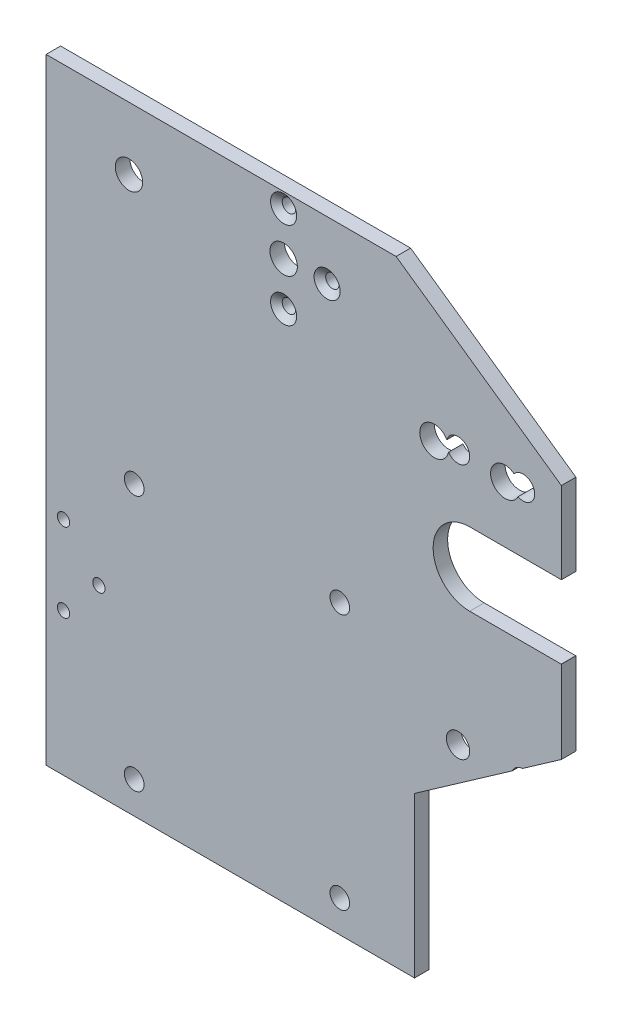
ISO-10303-21;
HEADER;
FILE_DESCRIPTION(('STEP AP214'),'2;1');
FILE_NAME('part.step','',(''),(''),'','','');
FILE_SCHEMA(('AUTOMOTIVE_DESIGN { 1 0 10303 214 1 1 1 1 }'));
ENDSEC;
DATA;
#1=APPLICATION_CONTEXT('core data for automotive mechanical design processes');
#2=APPLICATION_PROTOCOL_DEFINITION('international standard','automotive_design',2000,#1);
#3=PRODUCT_CONTEXT('',#1,'mechanical');
#4=PRODUCT('Part','Part','',(#3));
#5=PRODUCT_RELATED_PRODUCT_CATEGORY('part','',(#4));
#6=PRODUCT_DEFINITION_FORMATION('','',#4);
#7=PRODUCT_DEFINITION_CONTEXT('part definition',#1,'design');
#8=PRODUCT_DEFINITION('design','',#6,#7);
#9=PRODUCT_DEFINITION_SHAPE('','',#8);
#10=(LENGTH_UNIT() NAMED_UNIT(*) SI_UNIT(.MILLI.,.METRE.));
#11=(NAMED_UNIT(*) PLANE_ANGLE_UNIT() SI_UNIT($,.RADIAN.));
#12=(NAMED_UNIT(*) SI_UNIT($,.STERADIAN.) SOLID_ANGLE_UNIT());
#13=UNCERTAINTY_MEASURE_WITH_UNIT(LENGTH_MEASURE(1.E-05),#10,'distance_accuracy_value','');
#14=(GEOMETRIC_REPRESENTATION_CONTEXT(3) GLOBAL_UNCERTAINTY_ASSIGNED_CONTEXT((#13)) GLOBAL_UNIT_ASSIGNED_CONTEXT((#10,
#11,#12)) REPRESENTATION_CONTEXT('',''));
#15=CARTESIAN_POINT('',(0.,0.,0.));
#16=DIRECTION('',(0.,0.,1.));
#17=DIRECTION('',(1.,0.,0.));
#18=AXIS2_PLACEMENT_3D('',#15,#16,#17);
#19=CARTESIAN_POINT('',(80.144,22.4872878022684,11.8));
#20=DIRECTION('',(0.57357643635105,-0.819152044288989,0.));
#21=DIRECTION('',(0.819152044288989,0.57357643635105,0.));
#22=AXIS2_PLACEMENT_3D('',#19,#20,#21);
#23=PLANE('',#22);
#24=DIRECTION('',(0.,0.,1.));
#25=VECTOR('',#24,1.);
#26=CARTESIAN_POINT('',(71.6210299751706,16.5194399429474,14.975));
#27=LINE('',#26,#25);
#28=CARTESIAN_POINT('',(71.6210299751706,16.5194399429473,11.8));
#29=VERTEX_POINT('',#28);
#30=CARTESIAN_POINT('',(71.6210299751706,16.5194399429474,14.975));
#31=VERTEX_POINT('',#30);
#32=EDGE_CURVE('E11',#29,#31,#27,.T.);
#33=ORIENTED_EDGE('',*,*,#32,.F.);
#34=DIRECTION('',(-0.819152044288989,-0.57357643635105,0.));
#35=VECTOR('',#34,1.);
#36=CARTESIAN_POINT('',(53.1338099316063,3.57454910790182,11.8));
#37=LINE('',#36,#35);
#38=CARTESIAN_POINT('',(80.144,22.4872878022684,11.8));
#39=VERTEX_POINT('',#38);
#40=EDGE_CURVE('E170',#39,#29,#37,.T.);
#41=ORIENTED_EDGE('',*,*,#40,.F.);
#42=DIRECTION('',(0.,0.,-1.));
#43=VECTOR('',#42,1.);
#44=CARTESIAN_POINT('',(80.144,22.4872878022684,11.8));
#45=LINE('',#44,#43);
#46=CARTESIAN_POINT('',(80.144,22.4872878022684,14.975));
#47=VERTEX_POINT('',#46);
#48=EDGE_CURVE('E310',#47,#39,#45,.T.);
#49=ORIENTED_EDGE('',*,*,#48,.F.);
#50=DIRECTION('',(-0.819152044288989,-0.57357643635105,0.));
#51=VECTOR('',#50,1.);
#52=CARTESIAN_POINT('',(80.144,22.4872878022684,14.975));
#53=LINE('',#52,#51);
#54=EDGE_CURVE('E173',#47,#31,#53,.T.);
#55=ORIENTED_EDGE('',*,*,#54,.T.);
#56=EDGE_LOOP('',(#33,#41,#49,#55));
#57=FACE_BOUND('',#56,.T.);
#58=ADVANCED_FACE('F33',(#57),#23,.T.);
#59=CARTESIAN_POINT('',(80.144,-35.,11.8));
#60=DIRECTION('',(0.,0.,-1.));
#61=DIRECTION('',(-1.,0.,0.));
#62=AXIS2_PLACEMENT_3D('',#59,#60,#61);
#63=PLANE('',#62);
#64=CARTESIAN_POINT('',(-14.5061,86.034,11.8));
#65=DIRECTION('',(0.,0.,1.));
#66=DIRECTION('',(1.,0.,0.));
#67=AXIS2_PLACEMENT_3D('',#64,#65,#66);
#68=CIRCLE('',#67,2.9972);
#69=CARTESIAN_POINT('',(-11.5089,86.034,11.8));
#70=VERTEX_POINT('',#69);
#71=EDGE_CURVE('E503',#70,#70,#68,.T.);
#72=ORIENTED_EDGE('',*,*,#71,.T.);
#73=EDGE_LOOP('',(#72));
#74=FACE_BOUND('',#73,.T.);
#75=CARTESIAN_POINT('',(57.526,13.97,11.8));
#76=DIRECTION('',(0.,0.,1.));
#77=DIRECTION('',(1.,0.,0.));
#78=AXIS2_PLACEMENT_3D('',#75,#76,#77);
#79=CIRCLE('',#78,2.5527);
#80=CARTESIAN_POINT('',(60.0787,13.97,11.8));
#81=VERTEX_POINT('',#80);
#82=EDGE_CURVE('E360',#81,#81,#79,.T.);
#83=ORIENTED_EDGE('',*,*,#82,.T.);
#84=EDGE_LOOP('',(#83));
#85=FACE_BOUND('',#84,.T.);
#86=CARTESIAN_POINT('',(71.75,13.97,11.8));
#87=DIRECTION('',(0.,0.,1.));
#88=DIRECTION('',(1.,0.,0.));
#89=AXIS2_PLACEMENT_3D('',#86,#87,#88);
#90=CIRCLE('',#89,2.55269999999999);
#91=CARTESIAN_POINT('',(69.3984204448524,14.9631519953218,11.8));
#92=VERTEX_POINT('',#91);
#93=EDGE_CURVE('E161',#29,#92,#90,.T.);
#94=ORIENTED_EDGE('',*,*,#93,.T.);
#95=CARTESIAN_POINT('',(48.,-0.0201833059448077,11.8));
#96=VERTEX_POINT('',#95);
#97=EDGE_CURVE('E181',#92,#96,#37,.T.);
#98=ORIENTED_EDGE('',*,*,#97,.T.);
#99=DIRECTION('',(0.,-1.,0.));
#100=VECTOR('',#99,1.);
#101=CARTESIAN_POINT('',(48.,-35.,11.8));
#102=LINE('',#101,#100);
#103=CARTESIAN_POINT('',(48.,-35.,11.8));
#104=VERTEX_POINT('',#103);
#105=EDGE_CURVE('E186',#96,#104,#102,.T.);
#106=ORIENTED_EDGE('',*,*,#105,.T.);
#107=DIRECTION('',(-1.,0.,0.));
#108=VECTOR('',#107,1.);
#109=CARTESIAN_POINT('',(80.144,-35.,11.8));
#110=LINE('',#109,#108);
#111=CARTESIAN_POINT('',(-32.638,-35.,11.8));
#112=VERTEX_POINT('',#111);
#113=EDGE_CURVE('E200',#104,#112,#110,.T.);
#114=ORIENTED_EDGE('',*,*,#113,.T.);
#115=DIRECTION('',(0.,1.,0.));
#116=VECTOR('',#115,1.);
#117=CARTESIAN_POINT('',(-32.638,-35.,11.8));
#118=LINE('',#117,#116);
#119=CARTESIAN_POINT('',(-32.638,99.75,11.8));
#120=VERTEX_POINT('',#119);
#121=EDGE_CURVE('E203',#112,#120,#118,.T.);
#122=ORIENTED_EDGE('',*,*,#121,.T.);
#123=DIRECTION('',(-1.,0.,0.));
#124=VECTOR('',#123,1.);
#125=CARTESIAN_POINT('',(80.144,99.75,11.8));
#126=LINE('',#125,#124);
#127=CARTESIAN_POINT('',(43.9646872762982,99.75,11.8));
#128=VERTEX_POINT('',#127);
#129=EDGE_CURVE('E192',#128,#120,#126,.T.);
#130=ORIENTED_EDGE('',*,*,#129,.F.);
#131=DIRECTION('',(0.819152044288993,-0.573576436351044,0.));
#132=VECTOR('',#131,1.);
#133=CARTESIAN_POINT('',(131.553160825192,38.4198905607832,11.8));
#134=LINE('',#133,#132);
#135=CARTESIAN_POINT('',(80.144,74.4169725036177,11.8));
#136=VERTEX_POINT('',#135);
#137=EDGE_CURVE('E272',#128,#136,#134,.T.);
#138=ORIENTED_EDGE('',*,*,#137,.T.);
#139=DIRECTION('',(0.,1.,0.));
#140=VECTOR('',#139,1.);
#141=CARTESIAN_POINT('',(80.144,-35.,11.8));
#142=LINE('',#141,#140);
#143=CARTESIAN_POINT('',(80.144,56.5500397172487,11.8));
#144=VERTEX_POINT('',#143);
#145=EDGE_CURVE('E208',#144,#136,#142,.T.);
#146=ORIENTED_EDGE('',*,*,#145,.F.);
#147=CARTESIAN_POINT('',(80.066,48.550419976286,11.8));
#148=DIRECTION('',(0.,0.,-1.));
#149=DIRECTION('',(-1.,0.,0.));
#150=AXIS2_PLACEMENT_3D('',#147,#148,#149);
#151=CIRCLE('',#150,8.00000000000001);
#152=CARTESIAN_POINT('',(80.066,56.550419976286,11.8));
#153=VERTEX_POINT('',#152);
#154=EDGE_CURVE('E285',#144,#153,#151,.F.);
#155=ORIENTED_EDGE('',*,*,#154,.T.);
#156=DIRECTION('',(-1.,0.,0.));
#157=VECTOR('',#156,1.);
#158=CARTESIAN_POINT('',(80.144,56.550419976286,11.8));
#159=LINE('',#158,#157);
#160=CARTESIAN_POINT('',(60.066,56.550419976286,11.8));
#161=VERTEX_POINT('',#160);
#162=EDGE_CURVE('E279',#153,#161,#159,.T.);
#163=ORIENTED_EDGE('',*,*,#162,.T.);
#164=CARTESIAN_POINT('',(60.066,48.550419976286,11.8));
#165=DIRECTION('',(0.,0.,-1.));
#166=DIRECTION('',(-1.,0.,0.));
#167=AXIS2_PLACEMENT_3D('',#164,#165,#166);
#168=CIRCLE('',#167,8.00000000000001);
#169=CARTESIAN_POINT('',(60.066,40.550419976286,11.8));
#170=VERTEX_POINT('',#169);
#171=EDGE_CURVE('E295',#161,#170,#168,.F.);
#172=ORIENTED_EDGE('',*,*,#171,.T.);
#173=DIRECTION('',(1.,0.,0.));
#174=VECTOR('',#173,1.);
#175=CARTESIAN_POINT('',(80.144,40.550419976286,11.8));
#176=LINE('',#175,#174);
#177=CARTESIAN_POINT('',(80.066,40.550419976286,11.8));
#178=VERTEX_POINT('',#177);
#179=EDGE_CURVE('E292',#170,#178,#176,.T.);
#180=ORIENTED_EDGE('',*,*,#179,.T.);
#181=CARTESIAN_POINT('',(80.144,40.5508002353233,11.8));
#182=VERTEX_POINT('',#181);
#183=EDGE_CURVE('E289',#178,#182,#151,.F.);
#184=ORIENTED_EDGE('',*,*,#183,.T.);
#185=EDGE_CURVE('E179',#39,#182,#142,.T.);
#186=ORIENTED_EDGE('',*,*,#185,.F.);
#187=ORIENTED_EDGE('',*,*,#40,.T.);
#188=EDGE_LOOP('',(#94,#98,#106,#114,#122,#130,#138,#146,#155,#163,#172,#180,#184,#186,#187));
#189=FACE_BOUND('',#188,.T.);
#190=CARTESIAN_POINT('',(71.75,69.85,11.8));
#191=DIRECTION('',(0.,0.,1.));
#192=DIRECTION('',(1.,0.,0.));
#193=AXIS2_PLACEMENT_3D('',#190,#191,#192);
#194=CIRCLE('',#193,2.55269999999999);
#195=CARTESIAN_POINT('',(70.6516698350332,67.5456675286053,11.8));
#196=VERTEX_POINT('',#195);
#197=CARTESIAN_POINT('',(69.7775469529654,71.4704031187466,11.8));
#198=VERTEX_POINT('',#197);
#199=EDGE_CURVE('E226',#196,#198,#194,.T.);
#200=ORIENTED_EDGE('',*,*,#199,.T.);
#201=CARTESIAN_POINT('',(67.8159999999999,68.9738137349449,11.8));
#202=DIRECTION('',(0.,0.,-1.));
#203=DIRECTION('',(-1.,0.,0.));
#204=AXIS2_PLACEMENT_3D('',#201,#202,#203);
#205=CIRCLE('',#204,3.175);
#206=EDGE_CURVE('E298',#198,#196,#205,.F.);
#207=ORIENTED_EDGE('',*,*,#206,.T.);
#208=EDGE_LOOP('',(#200,#207));
#209=FACE_BOUND('',#208,.T.);
#210=CARTESIAN_POINT('',(-28.824,-3.75800000000003,11.8));
#211=DIRECTION('',(0.,0.,1.));
#212=DIRECTION('',(1.,0.,0.));
#213=AXIS2_PLACEMENT_3D('',#210,#211,#212);
#214=CIRCLE('',#213,1.35255);
#215=CARTESIAN_POINT('',(-27.47145,-3.75800000000003,11.8));
#216=VERTEX_POINT('',#215);
#217=EDGE_CURVE('E376',#216,#216,#214,.T.);
#218=ORIENTED_EDGE('',*,*,#217,.T.);
#219=EDGE_LOOP('',(#218));
#220=FACE_BOUND('',#219,.T.);
#221=CARTESIAN_POINT('',(-21.077,4.87799999999997,11.8));
#222=DIRECTION('',(0.,0.,1.));
#223=DIRECTION('',(1.,0.,0.));
#224=AXIS2_PLACEMENT_3D('',#221,#222,#223);
#225=CIRCLE('',#224,1.35255);
#226=CARTESIAN_POINT('',(-19.72445,4.87799999999997,11.8));
#227=VERTEX_POINT('',#226);
#228=EDGE_CURVE('E382',#227,#227,#225,.T.);
#229=ORIENTED_EDGE('',*,*,#228,.T.);
#230=EDGE_LOOP('',(#229));
#231=FACE_BOUND('',#230,.T.);
#232=CARTESIAN_POINT('',(-28.824,13.514,11.8));
#233=DIRECTION('',(0.,0.,1.));
#234=DIRECTION('',(1.,0.,0.));
#235=AXIS2_PLACEMENT_3D('',#232,#233,#234);
#236=CIRCLE('',#235,1.35255);
#237=CARTESIAN_POINT('',(-27.47145,13.514,11.8));
#238=VERTEX_POINT('',#237);
#239=EDGE_CURVE('E388',#238,#238,#236,.T.);
#240=ORIENTED_EDGE('',*,*,#239,.T.);
#241=EDGE_LOOP('',(#240));
#242=FACE_BOUND('',#241,.T.);
#243=CARTESIAN_POINT('',(19.352,87.0000000000002,11.8));
#244=DIRECTION('',(0.,0.,-1.));
#245=DIRECTION('',(-1.,0.,0.));
#246=AXIS2_PLACEMENT_3D('',#243,#244,#245);
#247=CIRCLE('',#246,3.);
#248=CARTESIAN_POINT('',(16.352,87.0000000000002,11.8));
#249=VERTEX_POINT('',#248);
#250=EDGE_CURVE('E394',#249,#249,#247,.T.);
#251=ORIENTED_EDGE('',*,*,#250,.F.);
#252=EDGE_LOOP('',(#251));
#253=FACE_BOUND('',#252,.T.);
#254=CARTESIAN_POINT('',(19.352,96.5190714883335,11.8));
#255=DIRECTION('',(0.,0.,1.));
#256=DIRECTION('',(1.,0.,0.));
#257=AXIS2_PLACEMENT_3D('',#254,#255,#256);
#258=CIRCLE('',#257,1.4732);
#259=CARTESIAN_POINT('',(20.8252,96.5190714883335,11.8));
#260=VERTEX_POINT('',#259);
#261=EDGE_CURVE('E403',#260,#260,#258,.T.);
#262=ORIENTED_EDGE('',*,*,#261,.T.);
#263=EDGE_LOOP('',(#262));
#264=FACE_BOUND('',#263,.T.);
#265=CARTESIAN_POINT('',(28.8710714883333,87.0000000000002,11.8));
#266=DIRECTION('',(0.,0.,1.));
#267=DIRECTION('',(1.,0.,0.));
#268=AXIS2_PLACEMENT_3D('',#265,#266,#267);
#269=CIRCLE('',#268,1.4732);
#270=CARTESIAN_POINT('',(30.3442714883333,87.0000000000002,11.8));
#271=VERTEX_POINT('',#270);
#272=EDGE_CURVE('E412',#271,#271,#269,.T.);
#273=ORIENTED_EDGE('',*,*,#272,.T.);
#274=EDGE_LOOP('',(#273));
#275=FACE_BOUND('',#274,.T.);
#276=CARTESIAN_POINT('',(19.352,77.4809285116669,11.8));
#277=DIRECTION('',(0.,0.,1.));
#278=DIRECTION('',(1.,0.,0.));
#279=AXIS2_PLACEMENT_3D('',#276,#277,#278);
#280=CIRCLE('',#279,1.4732);
#281=CARTESIAN_POINT('',(20.8252,77.4809285116669,11.8));
#282=VERTEX_POINT('',#281);
#283=EDGE_CURVE('E421',#282,#282,#280,.T.);
#284=ORIENTED_EDGE('',*,*,#283,.T.);
#285=EDGE_LOOP('',(#284));
#286=FACE_BOUND('',#285,.T.);
#287=CARTESIAN_POINT('',(-13.356,28.,11.8));
#288=DIRECTION('',(0.,0.,1.));
#289=DIRECTION('',(1.,0.,0.));
#290=AXIS2_PLACEMENT_3D('',#287,#288,#289);
#291=CIRCLE('',#290,2.15);
#292=CARTESIAN_POINT('',(-11.206,28.,11.8));
#293=VERTEX_POINT('',#292);
#294=EDGE_CURVE('E427',#293,#293,#291,.T.);
#295=ORIENTED_EDGE('',*,*,#294,.T.);
#296=EDGE_LOOP('',(#295));
#297=FACE_BOUND('',#296,.T.);
#298=CARTESIAN_POINT('',(31.644,28.,11.8));
#299=DIRECTION('',(0.,0.,1.));
#300=DIRECTION('',(1.,0.,0.));
#301=AXIS2_PLACEMENT_3D('',#298,#299,#300);
#302=CIRCLE('',#301,2.15);
#303=CARTESIAN_POINT('',(33.794,28.,11.8));
#304=VERTEX_POINT('',#303);
#305=EDGE_CURVE('E433',#304,#304,#302,.T.);
#306=ORIENTED_EDGE('',*,*,#305,.T.);
#307=EDGE_LOOP('',(#306));
#308=FACE_BOUND('',#307,.T.);
#309=CARTESIAN_POINT('',(31.644,-28.,11.8));
#310=DIRECTION('',(0.,0.,1.));
#311=DIRECTION('',(1.,0.,0.));
#312=AXIS2_PLACEMENT_3D('',#309,#310,#311);
#313=CIRCLE('',#312,2.15);
#314=CARTESIAN_POINT('',(33.794,-28.,11.8));
#315=VERTEX_POINT('',#314);
#316=EDGE_CURVE('E439',#315,#315,#313,.T.);
#317=ORIENTED_EDGE('',*,*,#316,.T.);
#318=EDGE_LOOP('',(#317));
#319=FACE_BOUND('',#318,.T.);
#320=CARTESIAN_POINT('',(-13.356,-28.,11.8));
#321=DIRECTION('',(0.,0.,1.));
#322=DIRECTION('',(1.,0.,0.));
#323=AXIS2_PLACEMENT_3D('',#320,#321,#322);
#324=CIRCLE('',#323,2.15);
#325=CARTESIAN_POINT('',(-11.206,-28.,11.8));
#326=VERTEX_POINT('',#325);
#327=EDGE_CURVE('E244',#326,#326,#324,.T.);
#328=ORIENTED_EDGE('',*,*,#327,.T.);
#329=EDGE_LOOP('',(#328));
#330=FACE_BOUND('',#329,.T.);
#331=CARTESIAN_POINT('',(52.3159999999998,68.9738137349447,11.8));
#332=DIRECTION('',(0.,0.,-1.));
#333=DIRECTION('',(-1.,0.,0.));
#334=AXIS2_PLACEMENT_3D('',#331,#332,#333);
#335=CIRCLE('',#334,3.175);
#336=CARTESIAN_POINT('',(55.0714782371765,70.5511420724971,11.8));
#337=VERTEX_POINT('',#336);
#338=CARTESIAN_POINT('',(55.4358407315599,68.3845609795853,11.8));
#339=VERTEX_POINT('',#338);
#340=EDGE_CURVE('E300',#337,#339,#335,.F.);
#341=ORIENTED_EDGE('',*,*,#340,.T.);
#342=CARTESIAN_POINT('',(57.526,69.85,11.8));
#343=DIRECTION('',(0.,0.,1.));
#344=DIRECTION('',(1.,0.,0.));
#345=AXIS2_PLACEMENT_3D('',#342,#343,#344);
#346=CIRCLE('',#345,2.5527);
#347=EDGE_CURVE('E370',#339,#337,#346,.T.);
#348=ORIENTED_EDGE('',*,*,#347,.T.);
#349=EDGE_LOOP('',(#341,#348));
#350=FACE_BOUND('',#349,.T.);
#351=ADVANCED_FACE('F175',(#74,#85,#189,#209,#220,#231,#242,#253,#264,#275,#286,#297,#308,#319,
#330,#350),#63,.T.);
#352=CARTESIAN_POINT('',(80.144,-35.,14.975));
#353=DIRECTION('',(1.,0.,0.));
#354=DIRECTION('',(0.,0.,-1.));
#355=AXIS2_PLACEMENT_3D('',#352,#353,#354);
#356=PLANE('',#355);
#357=ORIENTED_EDGE('',*,*,#145,.T.);
#358=DIRECTION('',(0.,0.,-1.));
#359=VECTOR('',#358,1.);
#360=CARTESIAN_POINT('',(80.144,74.4169725036177,11.8));
#361=LINE('',#360,#359);
#362=CARTESIAN_POINT('',(80.144,74.4169725036177,14.975));
#363=VERTEX_POINT('',#362);
#364=EDGE_CURVE('E241',#363,#136,#361,.T.);
#365=ORIENTED_EDGE('',*,*,#364,.F.);
#366=DIRECTION('',(0.,1.,0.));
#367=VECTOR('',#366,1.);
#368=CARTESIAN_POINT('',(80.144,-35.,14.975));
#369=LINE('',#368,#367);
#370=CARTESIAN_POINT('',(80.144,56.5500397172487,14.975));
#371=VERTEX_POINT('',#370);
#372=EDGE_CURVE('E212',#371,#363,#369,.T.);
#373=ORIENTED_EDGE('',*,*,#372,.F.);
#374=DIRECTION('',(0.,0.,-1.));
#375=VECTOR('',#374,1.);
#376=CARTESIAN_POINT('',(80.144,56.5500397172487,11.8));
#377=LINE('',#376,#375);
#378=EDGE_CURVE('E282',#371,#144,#377,.T.);
#379=ORIENTED_EDGE('',*,*,#378,.T.);
#380=EDGE_LOOP('',(#357,#365,#373,#379));
#381=FACE_BOUND('',#380,.T.);
#382=ADVANCED_FACE('F341',(#381),#356,.T.);
#383=ORIENTED_EDGE('',*,*,#185,.T.);
#384=DIRECTION('',(0.,0.,-1.));
#385=VECTOR('',#384,1.);
#386=CARTESIAN_POINT('',(80.144,40.5508002353233,11.8));
#387=LINE('',#386,#385);
#388=CARTESIAN_POINT('',(80.144,40.5508002353233,14.975));
#389=VERTEX_POINT('',#388);
#390=EDGE_CURVE('E288',#182,#389,#387,.F.);
#391=ORIENTED_EDGE('',*,*,#390,.T.);
#392=EDGE_CURVE('E209',#47,#389,#369,.T.);
#393=ORIENTED_EDGE('',*,*,#392,.F.);
#394=ORIENTED_EDGE('',*,*,#48,.T.);
#395=EDGE_LOOP('',(#383,#391,#393,#394));
#396=FACE_BOUND('',#395,.T.);
#397=ADVANCED_FACE('F357',(#396),#356,.T.);
#398=CARTESIAN_POINT('',(-32.638,-35.,14.975));
#399=DIRECTION('',(0.,0.,1.));
#400=DIRECTION('',(1.,0.,0.));
#401=AXIS2_PLACEMENT_3D('',#398,#399,#400);
#402=PLANE('',#401);
#403=CARTESIAN_POINT('',(-14.5061,86.034,14.975));
#404=DIRECTION('',(0.,0.,1.));
#405=DIRECTION('',(1.,0.,0.));
#406=AXIS2_PLACEMENT_3D('',#403,#404,#405);
#407=CIRCLE('',#406,2.9972);
#408=CARTESIAN_POINT('',(-11.5089,86.034,14.975));
#409=VERTEX_POINT('',#408);
#410=EDGE_CURVE('E499',#409,#409,#407,.T.);
#411=ORIENTED_EDGE('',*,*,#410,.F.);
#412=EDGE_LOOP('',(#411));
#413=FACE_BOUND('',#412,.T.);
#414=CARTESIAN_POINT('',(57.526,13.97,14.975));
#415=DIRECTION('',(0.,0.,1.));
#416=DIRECTION('',(1.,0.,0.));
#417=AXIS2_PLACEMENT_3D('',#414,#415,#416);
#418=CIRCLE('',#417,2.5527);
#419=CARTESIAN_POINT('',(60.0787,13.97,14.975));
#420=VERTEX_POINT('',#419);
#421=EDGE_CURVE('E363',#420,#420,#418,.T.);
#422=ORIENTED_EDGE('',*,*,#421,.F.);
#423=EDGE_LOOP('',(#422));
#424=FACE_BOUND('',#423,.T.);
#425=CARTESIAN_POINT('',(71.75,13.97,14.975));
#426=DIRECTION('',(0.,0.,1.));
#427=DIRECTION('',(1.,0.,0.));
#428=AXIS2_PLACEMENT_3D('',#425,#426,#427);
#429=CIRCLE('',#428,2.55270000000001);
#430=CARTESIAN_POINT('',(69.3984204448524,14.9631519953218,14.975));
#431=VERTEX_POINT('',#430);
#432=EDGE_CURVE('E47',#31,#431,#429,.T.);
#433=ORIENTED_EDGE('',*,*,#432,.F.);
#434=ORIENTED_EDGE('',*,*,#54,.F.);
#435=ORIENTED_EDGE('',*,*,#392,.T.);
#436=CARTESIAN_POINT('',(80.066,48.550419976286,14.975));
#437=DIRECTION('',(0.,0.,1.));
#438=DIRECTION('',(1.,0.,0.));
#439=AXIS2_PLACEMENT_3D('',#436,#437,#438);
#440=CIRCLE('',#439,8.00000000000001);
#441=CARTESIAN_POINT('',(80.066,40.550419976286,14.975));
#442=VERTEX_POINT('',#441);
#443=EDGE_CURVE('E256',#442,#389,#440,.T.);
#444=ORIENTED_EDGE('',*,*,#443,.F.);
#445=DIRECTION('',(1.,0.,0.));
#446=VECTOR('',#445,1.);
#447=CARTESIAN_POINT('',(60.066,40.550419976286,14.975));
#448=LINE('',#447,#446);
#449=CARTESIAN_POINT('',(60.066,40.550419976286,14.975));
#450=VERTEX_POINT('',#449);
#451=EDGE_CURVE('E252',#450,#442,#448,.T.);
#452=ORIENTED_EDGE('',*,*,#451,.F.);
#453=CARTESIAN_POINT('',(60.066,48.550419976286,14.975));
#454=DIRECTION('',(0.,0.,1.));
#455=DIRECTION('',(1.,0.,0.));
#456=AXIS2_PLACEMENT_3D('',#453,#454,#455);
#457=CIRCLE('',#456,8.00000000000001);
#458=CARTESIAN_POINT('',(60.066,56.550419976286,14.975));
#459=VERTEX_POINT('',#458);
#460=EDGE_CURVE('E249',#459,#450,#457,.T.);
#461=ORIENTED_EDGE('',*,*,#460,.F.);
#462=DIRECTION('',(-1.,0.,0.));
#463=VECTOR('',#462,1.);
#464=CARTESIAN_POINT('',(60.066,56.550419976286,14.975));
#465=LINE('',#464,#463);
#466=CARTESIAN_POINT('',(80.066,56.550419976286,14.975));
#467=VERTEX_POINT('',#466);
#468=EDGE_CURVE('E258',#467,#459,#465,.T.);
#469=ORIENTED_EDGE('',*,*,#468,.F.);
#470=CARTESIAN_POINT('',(80.066,48.550419976286,14.975));
#471=DIRECTION('',(0.,0.,1.));
#472=DIRECTION('',(1.,0.,0.));
#473=AXIS2_PLACEMENT_3D('',#470,#471,#472);
#474=CIRCLE('',#473,8.00000000000001);
#475=EDGE_CURVE('E206',#467,#371,#474,.F.);
#476=ORIENTED_EDGE('',*,*,#475,.T.);
#477=ORIENTED_EDGE('',*,*,#372,.T.);
#478=DIRECTION('',(0.819152044288993,-0.573576436351044,0.));
#479=VECTOR('',#478,1.);
#480=CARTESIAN_POINT('',(43.9646872762982,99.75,14.975));
#481=LINE('',#480,#479);
#482=CARTESIAN_POINT('',(43.9646872762982,99.75,14.975));
#483=VERTEX_POINT('',#482);
#484=EDGE_CURVE('E238',#483,#363,#481,.T.);
#485=ORIENTED_EDGE('',*,*,#484,.F.);
#486=DIRECTION('',(1.,0.,0.));
#487=VECTOR('',#486,1.);
#488=CARTESIAN_POINT('',(-32.638,99.75,14.975));
#489=LINE('',#488,#487);
#490=CARTESIAN_POINT('',(-32.638,99.75,14.975));
#491=VERTEX_POINT('',#490);
#492=EDGE_CURVE('E184',#491,#483,#489,.T.);
#493=ORIENTED_EDGE('',*,*,#492,.F.);
#494=DIRECTION('',(0.,1.,0.));
#495=VECTOR('',#494,1.);
#496=CARTESIAN_POINT('',(-32.638,-35.,14.975));
#497=LINE('',#496,#495);
#498=CARTESIAN_POINT('',(-32.638,-35.,14.975));
#499=VERTEX_POINT('',#498);
#500=EDGE_CURVE('E202',#499,#491,#497,.T.);
#501=ORIENTED_EDGE('',*,*,#500,.F.);
#502=DIRECTION('',(1.,0.,0.));
#503=VECTOR('',#502,1.);
#504=CARTESIAN_POINT('',(-32.638,-35.,14.975));
#505=LINE('',#504,#503);
#506=CARTESIAN_POINT('',(48.,-35.,14.975));
#507=VERTEX_POINT('',#506);
#508=EDGE_CURVE('E197',#499,#507,#505,.T.);
#509=ORIENTED_EDGE('',*,*,#508,.T.);
#510=DIRECTION('',(0.,-1.,0.));
#511=VECTOR('',#510,1.);
#512=CARTESIAN_POINT('',(48.,-35.,14.975));
#513=LINE('',#512,#511);
#514=CARTESIAN_POINT('',(48.,-0.0201833059448077,14.975));
#515=VERTEX_POINT('',#514);
#516=EDGE_CURVE('E303',#515,#507,#513,.T.);
#517=ORIENTED_EDGE('',*,*,#516,.F.);
#518=EDGE_CURVE('E305',#431,#515,#53,.T.);
#519=ORIENTED_EDGE('',*,*,#518,.F.);
#520=EDGE_LOOP('',(#433,#434,#435,#444,#452,#461,#469,#476,#477,#485,#493,#501,#509,#517,#519));
#521=FACE_BOUND('',#520,.T.);
#522=CARTESIAN_POINT('',(71.75,69.85,14.975));
#523=DIRECTION('',(0.,0.,1.));
#524=DIRECTION('',(1.,0.,0.));
#525=AXIS2_PLACEMENT_3D('',#522,#523,#524);
#526=CIRCLE('',#525,2.55270000000001);
#527=CARTESIAN_POINT('',(70.6516698350332,67.5456675286053,14.975));
#528=VERTEX_POINT('',#527);
#529=CARTESIAN_POINT('',(69.7775469529654,71.4704031187466,14.975));
#530=VERTEX_POINT('',#529);
#531=EDGE_CURVE('E55',#528,#530,#526,.T.);
#532=ORIENTED_EDGE('',*,*,#531,.F.);
#533=CARTESIAN_POINT('',(67.8159999999999,68.9738137349449,14.975));
#534=DIRECTION('',(0.,0.,1.));
#535=DIRECTION('',(1.,0.,0.));
#536=AXIS2_PLACEMENT_3D('',#533,#534,#535);
#537=CIRCLE('',#536,3.175);
#538=EDGE_CURVE('E235',#530,#528,#537,.T.);
#539=ORIENTED_EDGE('',*,*,#538,.F.);
#540=EDGE_LOOP('',(#532,#539));
#541=FACE_BOUND('',#540,.T.);
#542=CARTESIAN_POINT('',(57.526,69.85,14.975));
#543=DIRECTION('',(0.,0.,1.));
#544=DIRECTION('',(1.,0.,0.));
#545=AXIS2_PLACEMENT_3D('',#542,#543,#544);
#546=CIRCLE('',#545,2.5527);
#547=CARTESIAN_POINT('',(55.4358407315599,68.3845609795853,14.975));
#548=VERTEX_POINT('',#547);
#549=CARTESIAN_POINT('',(55.0714782371765,70.5511420724971,14.975));
#550=VERTEX_POINT('',#549);
#551=EDGE_CURVE('E368',#548,#550,#546,.T.);
#552=ORIENTED_EDGE('',*,*,#551,.F.);
#553=CARTESIAN_POINT('',(52.3159999999998,68.9738137349447,14.975));
#554=DIRECTION('',(0.,0.,1.));
#555=DIRECTION('',(1.,0.,0.));
#556=AXIS2_PLACEMENT_3D('',#553,#554,#555);
#557=CIRCLE('',#556,3.175);
#558=EDGE_CURVE('E239',#550,#548,#557,.T.);
#559=ORIENTED_EDGE('',*,*,#558,.F.);
#560=EDGE_LOOP('',(#552,#559));
#561=FACE_BOUND('',#560,.T.);
#562=CARTESIAN_POINT('',(-28.824,-3.75800000000003,14.975));
#563=DIRECTION('',(0.,0.,1.));
#564=DIRECTION('',(1.,0.,0.));
#565=AXIS2_PLACEMENT_3D('',#562,#563,#564);
#566=CIRCLE('',#565,1.35255);
#567=CARTESIAN_POINT('',(-27.47145,-3.75800000000003,14.975));
#568=VERTEX_POINT('',#567);
#569=EDGE_CURVE('E373',#568,#568,#566,.T.);
#570=ORIENTED_EDGE('',*,*,#569,.F.);
#571=EDGE_LOOP('',(#570));
#572=FACE_BOUND('',#571,.T.);
#573=CARTESIAN_POINT('',(-21.077,4.87799999999997,14.975));
#574=DIRECTION('',(0.,0.,1.));
#575=DIRECTION('',(1.,0.,0.));
#576=AXIS2_PLACEMENT_3D('',#573,#574,#575);
#577=CIRCLE('',#576,1.35255);
#578=CARTESIAN_POINT('',(-19.72445,4.87799999999997,14.975));
#579=VERTEX_POINT('',#578);
#580=EDGE_CURVE('E379',#579,#579,#577,.T.);
#581=ORIENTED_EDGE('',*,*,#580,.F.);
#582=EDGE_LOOP('',(#581));
#583=FACE_BOUND('',#582,.T.);
#584=CARTESIAN_POINT('',(-28.824,13.514,14.975));
#585=DIRECTION('',(0.,0.,1.));
#586=DIRECTION('',(1.,0.,0.));
#587=AXIS2_PLACEMENT_3D('',#584,#585,#586);
#588=CIRCLE('',#587,1.35255);
#589=CARTESIAN_POINT('',(-27.47145,13.514,14.975));
#590=VERTEX_POINT('',#589);
#591=EDGE_CURVE('E385',#590,#590,#588,.T.);
#592=ORIENTED_EDGE('',*,*,#591,.F.);
#593=EDGE_LOOP('',(#592));
#594=FACE_BOUND('',#593,.T.);
#595=CARTESIAN_POINT('',(19.352,87.0000000000002,14.975));
#596=DIRECTION('',(0.,0.,1.));
#597=DIRECTION('',(1.,0.,0.));
#598=AXIS2_PLACEMENT_3D('',#595,#596,#597);
#599=CIRCLE('',#598,3.);
#600=CARTESIAN_POINT('',(22.352,87.0000000000002,14.975));
#601=VERTEX_POINT('',#600);
#602=EDGE_CURVE('E391',#601,#601,#599,.T.);
#603=ORIENTED_EDGE('',*,*,#602,.F.);
#604=EDGE_LOOP('',(#603));
#605=FACE_BOUND('',#604,.T.);
#606=CARTESIAN_POINT('',(19.352,96.5190714883335,14.975));
#607=DIRECTION('',(0.,0.,1.));
#608=DIRECTION('',(1.,0.,0.));
#609=AXIS2_PLACEMENT_3D('',#606,#607,#608);
#610=CIRCLE('',#609,2.8575);
#611=CARTESIAN_POINT('',(22.2095,96.5190714883335,14.975));
#612=VERTEX_POINT('',#611);
#613=EDGE_CURVE('E397',#612,#612,#610,.T.);
#614=ORIENTED_EDGE('',*,*,#613,.F.);
#615=EDGE_LOOP('',(#614));
#616=FACE_BOUND('',#615,.T.);
#617=CARTESIAN_POINT('',(28.8710714883333,87.0000000000002,14.975));
#618=DIRECTION('',(0.,0.,1.));
#619=DIRECTION('',(1.,0.,0.));
#620=AXIS2_PLACEMENT_3D('',#617,#618,#619);
#621=CIRCLE('',#620,2.8575);
#622=CARTESIAN_POINT('',(31.7285714883333,87.0000000000002,14.975));
#623=VERTEX_POINT('',#622);
#624=EDGE_CURVE('E406',#623,#623,#621,.T.);
#625=ORIENTED_EDGE('',*,*,#624,.F.);
#626=EDGE_LOOP('',(#625));
#627=FACE_BOUND('',#626,.T.);
#628=CARTESIAN_POINT('',(19.352,77.4809285116669,14.975));
#629=DIRECTION('',(0.,0.,1.));
#630=DIRECTION('',(1.,0.,0.));
#631=AXIS2_PLACEMENT_3D('',#628,#629,#630);
#632=CIRCLE('',#631,2.8575);
#633=CARTESIAN_POINT('',(22.2095,77.4809285116669,14.975));
#634=VERTEX_POINT('',#633);
#635=EDGE_CURVE('E415',#634,#634,#632,.T.);
#636=ORIENTED_EDGE('',*,*,#635,.F.);
#637=EDGE_LOOP('',(#636));
#638=FACE_BOUND('',#637,.T.);
#639=CARTESIAN_POINT('',(-13.356,28.,14.975));
#640=DIRECTION('',(0.,0.,1.));
#641=DIRECTION('',(1.,0.,0.));
#642=AXIS2_PLACEMENT_3D('',#639,#640,#641);
#643=CIRCLE('',#642,2.15);
#644=CARTESIAN_POINT('',(-11.206,28.,14.975));
#645=VERTEX_POINT('',#644);
#646=EDGE_CURVE('E424',#645,#645,#643,.T.);
#647=ORIENTED_EDGE('',*,*,#646,.F.);
#648=EDGE_LOOP('',(#647));
#649=FACE_BOUND('',#648,.T.);
#650=CARTESIAN_POINT('',(31.644,28.,14.975));
#651=DIRECTION('',(0.,0.,1.));
#652=DIRECTION('',(1.,0.,0.));
#653=AXIS2_PLACEMENT_3D('',#650,#651,#652);
#654=CIRCLE('',#653,2.15);
#655=CARTESIAN_POINT('',(33.794,28.,14.975));
#656=VERTEX_POINT('',#655);
#657=EDGE_CURVE('E430',#656,#656,#654,.T.);
#658=ORIENTED_EDGE('',*,*,#657,.F.);
#659=EDGE_LOOP('',(#658));
#660=FACE_BOUND('',#659,.T.);
#661=CARTESIAN_POINT('',(31.644,-28.,14.975));
#662=DIRECTION('',(0.,0.,1.));
#663=DIRECTION('',(1.,0.,0.));
#664=AXIS2_PLACEMENT_3D('',#661,#662,#663);
#665=CIRCLE('',#664,2.15);
#666=CARTESIAN_POINT('',(33.794,-28.,14.975));
#667=VERTEX_POINT('',#666);
#668=EDGE_CURVE('E436',#667,#667,#665,.T.);
#669=ORIENTED_EDGE('',*,*,#668,.F.);
#670=EDGE_LOOP('',(#669));
#671=FACE_BOUND('',#670,.T.);
#672=CARTESIAN_POINT('',(-13.356,-28.,14.975));
#673=DIRECTION('',(0.,0.,1.));
#674=DIRECTION('',(1.,0.,0.));
#675=AXIS2_PLACEMENT_3D('',#672,#673,#674);
#676=CIRCLE('',#675,2.15);
#677=CARTESIAN_POINT('',(-11.206,-28.,14.975));
#678=VERTEX_POINT('',#677);
#679=EDGE_CURVE('E441',#678,#678,#676,.T.);
#680=ORIENTED_EDGE('',*,*,#679,.F.);
#681=EDGE_LOOP('',(#680));
#682=FACE_BOUND('',#681,.T.);
#683=ADVANCED_FACE('F233',(#413,#424,#521,#541,#561,#572,#583,#594,#605,#616,#627,#638,#649,
#660,#671,#682),#402,.T.);
#684=CARTESIAN_POINT('',(0.,99.75,0.));
#685=DIRECTION('',(0.,1.,0.));
#686=DIRECTION('',(0.,0.,1.));
#687=AXIS2_PLACEMENT_3D('',#684,#685,#686);
#688=PLANE('',#687);
#689=ORIENTED_EDGE('',*,*,#492,.T.);
#690=DIRECTION('',(0.,0.,-1.));
#691=VECTOR('',#690,1.);
#692=CARTESIAN_POINT('',(43.9646872762982,99.75,11.8));
#693=LINE('',#692,#691);
#694=EDGE_CURVE('E253',#483,#128,#693,.T.);
#695=ORIENTED_EDGE('',*,*,#694,.T.);
#696=ORIENTED_EDGE('',*,*,#129,.T.);
#697=DIRECTION('',(0.,0.,1.));
#698=VECTOR('',#697,1.);
#699=CARTESIAN_POINT('',(-32.638,99.75,11.8));
#700=LINE('',#699,#698);
#701=EDGE_CURVE('E180',#120,#491,#700,.T.);
#702=ORIENTED_EDGE('',*,*,#701,.T.);
#703=EDGE_LOOP('',(#689,#695,#696,#702));
#704=FACE_BOUND('',#703,.T.);
#705=ADVANCED_FACE('F330',(#704),#688,.T.);
#706=CARTESIAN_POINT('',(0.,-35.,0.));
#707=DIRECTION('',(0.,1.,0.));
#708=DIRECTION('',(0.,0.,1.));
#709=AXIS2_PLACEMENT_3D('',#706,#707,#708);
#710=PLANE('',#709);
#711=DIRECTION('',(0.,0.,-1.));
#712=VECTOR('',#711,1.);
#713=CARTESIAN_POINT('',(48.,-35.,11.8));
#714=LINE('',#713,#712);
#715=EDGE_CURVE('E311',#507,#104,#714,.T.);
#716=ORIENTED_EDGE('',*,*,#715,.F.);
#717=ORIENTED_EDGE('',*,*,#508,.F.);
#718=DIRECTION('',(0.,0.,1.));
#719=VECTOR('',#718,1.);
#720=CARTESIAN_POINT('',(-32.638,-35.,11.8));
#721=LINE('',#720,#719);
#722=EDGE_CURVE('E194',#112,#499,#721,.T.);
#723=ORIENTED_EDGE('',*,*,#722,.F.);
#724=ORIENTED_EDGE('',*,*,#113,.F.);
#725=EDGE_LOOP('',(#716,#717,#723,#724));
#726=FACE_BOUND('',#725,.T.);
#727=ADVANCED_FACE('F321',(#726),#710,.F.);
#728=CARTESIAN_POINT('',(-32.638,-35.,11.8));
#729=DIRECTION('',(-1.,0.,0.));
#730=DIRECTION('',(0.,0.,1.));
#731=AXIS2_PLACEMENT_3D('',#728,#729,#730);
#732=PLANE('',#731);
#733=ORIENTED_EDGE('',*,*,#500,.T.);
#734=ORIENTED_EDGE('',*,*,#701,.F.);
#735=ORIENTED_EDGE('',*,*,#121,.F.);
#736=ORIENTED_EDGE('',*,*,#722,.T.);
#737=EDGE_LOOP('',(#733,#734,#735,#736));
#738=FACE_BOUND('',#737,.T.);
#739=ADVANCED_FACE('F35',(#738),#732,.T.);
#740=CARTESIAN_POINT('',(48.,-35.,11.8));
#741=DIRECTION('',(1.,0.,0.));
#742=DIRECTION('',(0.,0.,-1.));
#743=AXIS2_PLACEMENT_3D('',#740,#741,#742);
#744=PLANE('',#743);
#745=DIRECTION('',(0.,0.,-1.));
#746=VECTOR('',#745,1.);
#747=CARTESIAN_POINT('',(48.,-0.0201833059448077,11.8));
#748=LINE('',#747,#746);
#749=EDGE_CURVE('E307',#515,#96,#748,.T.);
#750=ORIENTED_EDGE('',*,*,#749,.F.);
#751=ORIENTED_EDGE('',*,*,#516,.T.);
#752=ORIENTED_EDGE('',*,*,#715,.T.);
#753=ORIENTED_EDGE('',*,*,#105,.F.);
#754=EDGE_LOOP('',(#750,#751,#752,#753));
#755=FACE_BOUND('',#754,.T.);
#756=ADVANCED_FACE('F476',(#755),#744,.T.);
#757=DIRECTION('',(0.,0.,1.));
#758=VECTOR('',#757,1.);
#759=CARTESIAN_POINT('',(69.3984204448524,14.9631519953218,14.975));
#760=LINE('',#759,#758);
#761=EDGE_CURVE('E41',#431,#92,#760,.F.);
#762=ORIENTED_EDGE('',*,*,#761,.F.);
#763=ORIENTED_EDGE('',*,*,#518,.T.);
#764=ORIENTED_EDGE('',*,*,#749,.T.);
#765=ORIENTED_EDGE('',*,*,#97,.F.);
#766=EDGE_LOOP('',(#762,#763,#764,#765));
#767=FACE_BOUND('',#766,.T.);
#768=ADVANCED_FACE('F467',(#767),#23,.T.);
#769=CARTESIAN_POINT('',(43.9646872762982,99.75,11.8));
#770=DIRECTION('',(0.573576436351044,0.819152044288993,0.));
#771=DIRECTION('',(-0.819152044288993,0.573576436351044,0.));
#772=AXIS2_PLACEMENT_3D('',#769,#770,#771);
#773=PLANE('',#772);
#774=ORIENTED_EDGE('',*,*,#694,.F.);
#775=ORIENTED_EDGE('',*,*,#484,.T.);
#776=ORIENTED_EDGE('',*,*,#364,.T.);
#777=ORIENTED_EDGE('',*,*,#137,.F.);
#778=EDGE_LOOP('',(#774,#775,#776,#777));
#779=FACE_BOUND('',#778,.T.);
#780=ADVANCED_FACE('F333',(#779),#773,.T.);
#781=CARTESIAN_POINT('',(80.066,48.550419976286,11.8));
#782=DIRECTION('',(0.,0.,-1.));
#783=DIRECTION('',(-1.,0.,0.));
#784=AXIS2_PLACEMENT_3D('',#781,#782,#783);
#785=CYLINDRICAL_SURFACE('',#784,8.00000000000001);
#786=DIRECTION('',(0.,0.,-1.));
#787=VECTOR('',#786,1.);
#788=CARTESIAN_POINT('',(80.066,40.550419976286,11.8));
#789=LINE('',#788,#787);
#790=EDGE_CURVE('E267',#442,#178,#789,.T.);
#791=ORIENTED_EDGE('',*,*,#790,.F.);
#792=ORIENTED_EDGE('',*,*,#443,.T.);
#793=ORIENTED_EDGE('',*,*,#390,.F.);
#794=ORIENTED_EDGE('',*,*,#183,.F.);
#795=EDGE_LOOP('',(#791,#792,#793,#794));
#796=FACE_BOUND('',#795,.T.);
#797=ADVANCED_FACE('F354',(#796),#785,.F.);
#798=CARTESIAN_POINT('',(60.066,48.550419976286,11.8));
#799=DIRECTION('',(0.,0.,-1.));
#800=DIRECTION('',(-1.,0.,0.));
#801=AXIS2_PLACEMENT_3D('',#798,#799,#800);
#802=CYLINDRICAL_SURFACE('',#801,8.00000000000001);
#803=DIRECTION('',(0.,0.,-1.));
#804=VECTOR('',#803,1.);
#805=CARTESIAN_POINT('',(60.066,56.550419976286,11.8));
#806=LINE('',#805,#804);
#807=EDGE_CURVE('E261',#459,#161,#806,.T.);
#808=ORIENTED_EDGE('',*,*,#807,.F.);
#809=ORIENTED_EDGE('',*,*,#460,.T.);
#810=DIRECTION('',(0.,0.,-1.));
#811=VECTOR('',#810,1.);
#812=CARTESIAN_POINT('',(60.066,40.550419976286,11.8));
#813=LINE('',#812,#811);
#814=EDGE_CURVE('E270',#450,#170,#813,.T.);
#815=ORIENTED_EDGE('',*,*,#814,.T.);
#816=ORIENTED_EDGE('',*,*,#171,.F.);
#817=EDGE_LOOP('',(#808,#809,#815,#816));
#818=FACE_BOUND('',#817,.T.);
#819=ADVANCED_FACE('F348',(#818),#802,.F.);
#820=CARTESIAN_POINT('',(60.066,40.550419976286,11.8));
#821=DIRECTION('',(0.,1.,0.));
#822=DIRECTION('',(0.,0.,1.));
#823=AXIS2_PLACEMENT_3D('',#820,#821,#822);
#824=PLANE('',#823);
#825=ORIENTED_EDGE('',*,*,#814,.F.);
#826=ORIENTED_EDGE('',*,*,#451,.T.);
#827=ORIENTED_EDGE('',*,*,#790,.T.);
#828=ORIENTED_EDGE('',*,*,#179,.F.);
#829=EDGE_LOOP('',(#825,#826,#827,#828));
#830=FACE_BOUND('',#829,.T.);
#831=ADVANCED_FACE('F351',(#830),#824,.T.);
#832=ORIENTED_EDGE('',*,*,#378,.F.);
#833=ORIENTED_EDGE('',*,*,#475,.F.);
#834=DIRECTION('',(0.,0.,-1.));
#835=VECTOR('',#834,1.);
#836=CARTESIAN_POINT('',(80.066,56.550419976286,11.8));
#837=LINE('',#836,#835);
#838=EDGE_CURVE('E264',#467,#153,#837,.T.);
#839=ORIENTED_EDGE('',*,*,#838,.T.);
#840=ORIENTED_EDGE('',*,*,#154,.F.);
#841=EDGE_LOOP('',(#832,#833,#839,#840));
#842=FACE_BOUND('',#841,.T.);
#843=ADVANCED_FACE('F343',(#842),#785,.F.);
#844=CARTESIAN_POINT('',(60.066,56.550419976286,11.8));
#845=DIRECTION('',(0.,-1.,0.));
#846=DIRECTION('',(0.,0.,-1.));
#847=AXIS2_PLACEMENT_3D('',#844,#845,#846);
#848=PLANE('',#847);
#849=ORIENTED_EDGE('',*,*,#838,.F.);
#850=ORIENTED_EDGE('',*,*,#468,.T.);
#851=ORIENTED_EDGE('',*,*,#807,.T.);
#852=ORIENTED_EDGE('',*,*,#162,.F.);
#853=EDGE_LOOP('',(#849,#850,#851,#852));
#854=FACE_BOUND('',#853,.T.);
#855=ADVANCED_FACE('F345',(#854),#848,.T.);
#856=CARTESIAN_POINT('',(67.8159999999999,68.9738137349449,11.8));
#857=DIRECTION('',(0.,0.,-1.));
#858=DIRECTION('',(-1.,0.,0.));
#859=AXIS2_PLACEMENT_3D('',#856,#857,#858);
#860=CYLINDRICAL_SURFACE('',#859,3.175);
#861=DIRECTION('',(0.,0.,1.));
#862=VECTOR('',#861,1.);
#863=CARTESIAN_POINT('',(70.6516698350332,67.5456675286053,13.3875));
#864=LINE('',#863,#862);
#865=EDGE_CURVE('E222',#196,#528,#864,.T.);
#866=ORIENTED_EDGE('',*,*,#865,.F.);
#867=ORIENTED_EDGE('',*,*,#206,.F.);
#868=DIRECTION('',(0.,0.,1.));
#869=VECTOR('',#868,1.);
#870=CARTESIAN_POINT('',(69.7775469529654,71.4704031187466,13.3875));
#871=LINE('',#870,#869);
#872=EDGE_CURVE('E220',#530,#198,#871,.F.);
#873=ORIENTED_EDGE('',*,*,#872,.F.);
#874=ORIENTED_EDGE('',*,*,#538,.T.);
#875=EDGE_LOOP('',(#866,#867,#873,#874));
#876=FACE_BOUND('',#875,.T.);
#877=ADVANCED_FACE('F237',(#876),#860,.F.);
#878=CARTESIAN_POINT('',(52.3159999999998,68.9738137349447,11.8));
#879=DIRECTION('',(0.,0.,-1.));
#880=DIRECTION('',(-1.,0.,0.));
#881=AXIS2_PLACEMENT_3D('',#878,#879,#880);
#882=CYLINDRICAL_SURFACE('',#881,3.175);
#883=DIRECTION('',(0.,0.,1.));
#884=VECTOR('',#883,1.);
#885=CARTESIAN_POINT('',(55.4358407315599,68.3845609795853,13.3875));
#886=LINE('',#885,#884);
#887=EDGE_CURVE('E218',#339,#548,#886,.T.);
#888=ORIENTED_EDGE('',*,*,#887,.F.);
#889=ORIENTED_EDGE('',*,*,#340,.F.);
#890=DIRECTION('',(0.,0.,1.));
#891=VECTOR('',#890,1.);
#892=CARTESIAN_POINT('',(55.0714782371765,70.5511420724971,13.3875));
#893=LINE('',#892,#891);
#894=EDGE_CURVE('E216',#550,#337,#893,.F.);
#895=ORIENTED_EDGE('',*,*,#894,.F.);
#896=ORIENTED_EDGE('',*,*,#558,.T.);
#897=EDGE_LOOP('',(#888,#889,#895,#896));
#898=FACE_BOUND('',#897,.T.);
#899=ADVANCED_FACE('F453',(#898),#882,.F.);
#900=CARTESIAN_POINT('',(-13.356,-28.,14.975));
#901=DIRECTION('',(0.,0.,1.));
#902=DIRECTION('',(1.,0.,0.));
#903=AXIS2_PLACEMENT_3D('',#900,#901,#902);
#904=CYLINDRICAL_SURFACE('',#903,2.15);
#905=ORIENTED_EDGE('',*,*,#327,.F.);
#906=EDGE_LOOP('',(#905));
#907=FACE_BOUND('',#906,.T.);
#908=ORIENTED_EDGE('',*,*,#679,.T.);
#909=EDGE_LOOP('',(#908));
#910=FACE_BOUND('',#909,.T.);
#911=ADVANCED_FACE('F450',(#907,#910),#904,.F.);
#912=CARTESIAN_POINT('',(31.644,-28.,14.975));
#913=DIRECTION('',(0.,0.,1.));
#914=DIRECTION('',(1.,0.,0.));
#915=AXIS2_PLACEMENT_3D('',#912,#913,#914);
#916=CYLINDRICAL_SURFACE('',#915,2.15);
#917=ORIENTED_EDGE('',*,*,#316,.F.);
#918=EDGE_LOOP('',(#917));
#919=FACE_BOUND('',#918,.T.);
#920=ORIENTED_EDGE('',*,*,#668,.T.);
#921=EDGE_LOOP('',(#920));
#922=FACE_BOUND('',#921,.T.);
#923=ADVANCED_FACE('F452',(#919,#922),#916,.F.);
#924=CARTESIAN_POINT('',(31.644,28.,14.975));
#925=DIRECTION('',(0.,0.,1.));
#926=DIRECTION('',(1.,0.,0.));
#927=AXIS2_PLACEMENT_3D('',#924,#925,#926);
#928=CYLINDRICAL_SURFACE('',#927,2.15);
#929=ORIENTED_EDGE('',*,*,#305,.F.);
#930=EDGE_LOOP('',(#929));
#931=FACE_BOUND('',#930,.T.);
#932=ORIENTED_EDGE('',*,*,#657,.T.);
#933=EDGE_LOOP('',(#932));
#934=FACE_BOUND('',#933,.T.);
#935=ADVANCED_FACE('F459',(#931,#934),#928,.F.);
#936=CARTESIAN_POINT('',(-13.356,28.,14.975));
#937=DIRECTION('',(0.,0.,1.));
#938=DIRECTION('',(1.,0.,0.));
#939=AXIS2_PLACEMENT_3D('',#936,#937,#938);
#940=CYLINDRICAL_SURFACE('',#939,2.15);
#941=ORIENTED_EDGE('',*,*,#294,.F.);
#942=EDGE_LOOP('',(#941));
#943=FACE_BOUND('',#942,.T.);
#944=ORIENTED_EDGE('',*,*,#646,.T.);
#945=EDGE_LOOP('',(#944));
#946=FACE_BOUND('',#945,.T.);
#947=ADVANCED_FACE('F567',(#943,#946),#940,.F.);
#948=CARTESIAN_POINT('',(19.352,77.4809285116669,14.975));
#949=DIRECTION('',(0.,0.,1.));
#950=DIRECTION('',(1.,0.,0.));
#951=AXIS2_PLACEMENT_3D('',#948,#949,#950);
#952=CYLINDRICAL_SURFACE('',#951,1.4732);
#953=ORIENTED_EDGE('',*,*,#283,.F.);
#954=EDGE_LOOP('',(#953));
#955=FACE_BOUND('',#954,.T.);
#956=CARTESIAN_POINT('',(19.352,77.4809285116669,13.8134343805613));
#957=DIRECTION('',(0.,0.,1.));
#958=DIRECTION('',(1.,0.,0.));
#959=AXIS2_PLACEMENT_3D('',#956,#957,#958);
#960=CIRCLE('',#959,1.4732);
#961=CARTESIAN_POINT('',(20.8252,77.4809285116669,13.8134343805613));
#962=VERTEX_POINT('',#961);
#963=EDGE_CURVE('E418',#962,#962,#960,.T.);
#964=ORIENTED_EDGE('',*,*,#963,.T.);
#965=EDGE_LOOP('',(#964));
#966=FACE_BOUND('',#965,.T.);
#967=ADVANCED_FACE('F563',(#955,#966),#952,.F.);
#968=CARTESIAN_POINT('',(19.352,77.4809285116669,14.975));
#969=DIRECTION('',(0.,0.,1.));
#970=DIRECTION('',(1.,0.,0.));
#971=AXIS2_PLACEMENT_3D('',#968,#969,#970);
#972=CONICAL_SURFACE('',#971,2.8575,0.872664625997165);
#973=ORIENTED_EDGE('',*,*,#963,.F.);
#974=EDGE_LOOP('',(#973));
#975=FACE_BOUND('',#974,.T.);
#976=ORIENTED_EDGE('',*,*,#635,.T.);
#977=EDGE_LOOP('',(#976));
#978=FACE_BOUND('',#977,.T.);
#979=ADVANCED_FACE('F559',(#975,#978),#972,.F.);
#980=CARTESIAN_POINT('',(28.8710714883333,87.0000000000002,14.975));
#981=DIRECTION('',(0.,0.,1.));
#982=DIRECTION('',(1.,0.,0.));
#983=AXIS2_PLACEMENT_3D('',#980,#981,#982);
#984=CYLINDRICAL_SURFACE('',#983,1.4732);
#985=ORIENTED_EDGE('',*,*,#272,.F.);
#986=EDGE_LOOP('',(#985));
#987=FACE_BOUND('',#986,.T.);
#988=CARTESIAN_POINT('',(28.8710714883333,87.0000000000002,13.8134343805613));
#989=DIRECTION('',(0.,0.,1.));
#990=DIRECTION('',(1.,0.,0.));
#991=AXIS2_PLACEMENT_3D('',#988,#989,#990);
#992=CIRCLE('',#991,1.4732);
#993=CARTESIAN_POINT('',(30.3442714883333,87.0000000000002,13.8134343805613));
#994=VERTEX_POINT('',#993);
#995=EDGE_CURVE('E409',#994,#994,#992,.T.);
#996=ORIENTED_EDGE('',*,*,#995,.T.);
#997=EDGE_LOOP('',(#996));
#998=FACE_BOUND('',#997,.T.);
#999=ADVANCED_FACE('F555',(#987,#998),#984,.F.);
#1000=CARTESIAN_POINT('',(28.8710714883333,87.0000000000002,14.975));
#1001=DIRECTION('',(0.,0.,1.));
#1002=DIRECTION('',(1.,0.,0.));
#1003=AXIS2_PLACEMENT_3D('',#1000,#1001,#1002);
#1004=CONICAL_SURFACE('',#1003,2.8575,0.872664625997165);
#1005=ORIENTED_EDGE('',*,*,#995,.F.);
#1006=EDGE_LOOP('',(#1005));
#1007=FACE_BOUND('',#1006,.T.);
#1008=ORIENTED_EDGE('',*,*,#624,.T.);
#1009=EDGE_LOOP('',(#1008));
#1010=FACE_BOUND('',#1009,.T.);
#1011=ADVANCED_FACE('F551',(#1007,#1010),#1004,.F.);
#1012=CARTESIAN_POINT('',(19.352,96.5190714883335,14.975));
#1013=DIRECTION('',(0.,0.,1.));
#1014=DIRECTION('',(1.,0.,0.));
#1015=AXIS2_PLACEMENT_3D('',#1012,#1013,#1014);
#1016=CYLINDRICAL_SURFACE('',#1015,1.4732);
#1017=ORIENTED_EDGE('',*,*,#261,.F.);
#1018=EDGE_LOOP('',(#1017));
#1019=FACE_BOUND('',#1018,.T.);
#1020=CARTESIAN_POINT('',(19.352,96.5190714883335,13.8134343805613));
#1021=DIRECTION('',(0.,0.,1.));
#1022=DIRECTION('',(1.,0.,0.));
#1023=AXIS2_PLACEMENT_3D('',#1020,#1021,#1022);
#1024=CIRCLE('',#1023,1.4732);
#1025=CARTESIAN_POINT('',(20.8252,96.5190714883335,13.8134343805613));
#1026=VERTEX_POINT('',#1025);
#1027=EDGE_CURVE('E400',#1026,#1026,#1024,.T.);
#1028=ORIENTED_EDGE('',*,*,#1027,.T.);
#1029=EDGE_LOOP('',(#1028));
#1030=FACE_BOUND('',#1029,.T.);
#1031=ADVANCED_FACE('F547',(#1019,#1030),#1016,.F.);
#1032=CARTESIAN_POINT('',(19.352,96.5190714883335,14.975));
#1033=DIRECTION('',(0.,0.,1.));
#1034=DIRECTION('',(1.,0.,0.));
#1035=AXIS2_PLACEMENT_3D('',#1032,#1033,#1034);
#1036=CONICAL_SURFACE('',#1035,2.8575,0.872664625997165);
#1037=ORIENTED_EDGE('',*,*,#1027,.F.);
#1038=EDGE_LOOP('',(#1037));
#1039=FACE_BOUND('',#1038,.T.);
#1040=ORIENTED_EDGE('',*,*,#613,.T.);
#1041=EDGE_LOOP('',(#1040));
#1042=FACE_BOUND('',#1041,.T.);
#1043=ADVANCED_FACE('F543',(#1039,#1042),#1036,.F.);
#1044=CARTESIAN_POINT('',(19.352,87.0000000000002,11.475));
#1045=DIRECTION('',(0.,0.,1.));
#1046=DIRECTION('',(1.,0.,0.));
#1047=AXIS2_PLACEMENT_3D('',#1044,#1045,#1046);
#1048=CYLINDRICAL_SURFACE('',#1047,3.);
#1049=ORIENTED_EDGE('',*,*,#250,.T.);
#1050=EDGE_LOOP('',(#1049));
#1051=FACE_BOUND('',#1050,.T.);
#1052=ORIENTED_EDGE('',*,*,#602,.T.);
#1053=EDGE_LOOP('',(#1052));
#1054=FACE_BOUND('',#1053,.T.);
#1055=ADVANCED_FACE('F539',(#1051,#1054),#1048,.F.);
#1056=CARTESIAN_POINT('',(-28.824,13.514,14.975));
#1057=DIRECTION('',(0.,0.,1.));
#1058=DIRECTION('',(1.,0.,0.));
#1059=AXIS2_PLACEMENT_3D('',#1056,#1057,#1058);
#1060=CYLINDRICAL_SURFACE('',#1059,1.35255);
#1061=ORIENTED_EDGE('',*,*,#239,.F.);
#1062=EDGE_LOOP('',(#1061));
#1063=FACE_BOUND('',#1062,.T.);
#1064=ORIENTED_EDGE('',*,*,#591,.T.);
#1065=EDGE_LOOP('',(#1064));
#1066=FACE_BOUND('',#1065,.T.);
#1067=ADVANCED_FACE('F535',(#1063,#1066),#1060,.F.);
#1068=CARTESIAN_POINT('',(-21.077,4.87799999999997,14.975));
#1069=DIRECTION('',(0.,0.,1.));
#1070=DIRECTION('',(1.,0.,0.));
#1071=AXIS2_PLACEMENT_3D('',#1068,#1069,#1070);
#1072=CYLINDRICAL_SURFACE('',#1071,1.35255);
#1073=ORIENTED_EDGE('',*,*,#228,.F.);
#1074=EDGE_LOOP('',(#1073));
#1075=FACE_BOUND('',#1074,.T.);
#1076=ORIENTED_EDGE('',*,*,#580,.T.);
#1077=EDGE_LOOP('',(#1076));
#1078=FACE_BOUND('',#1077,.T.);
#1079=ADVANCED_FACE('F531',(#1075,#1078),#1072,.F.);
#1080=CARTESIAN_POINT('',(-28.824,-3.75800000000003,14.975));
#1081=DIRECTION('',(0.,0.,1.));
#1082=DIRECTION('',(1.,0.,0.));
#1083=AXIS2_PLACEMENT_3D('',#1080,#1081,#1082);
#1084=CYLINDRICAL_SURFACE('',#1083,1.35255);
#1085=ORIENTED_EDGE('',*,*,#217,.F.);
#1086=EDGE_LOOP('',(#1085));
#1087=FACE_BOUND('',#1086,.T.);
#1088=ORIENTED_EDGE('',*,*,#569,.T.);
#1089=EDGE_LOOP('',(#1088));
#1090=FACE_BOUND('',#1089,.T.);
#1091=ADVANCED_FACE('F527',(#1087,#1090),#1084,.F.);
#1092=CARTESIAN_POINT('',(57.526,69.85,14.975));
#1093=DIRECTION('',(0.,0.,1.));
#1094=DIRECTION('',(1.,0.,0.));
#1095=AXIS2_PLACEMENT_3D('',#1092,#1093,#1094);
#1096=CYLINDRICAL_SURFACE('',#1095,2.5527);
#1097=ORIENTED_EDGE('',*,*,#887,.T.);
#1098=ORIENTED_EDGE('',*,*,#551,.T.);
#1099=ORIENTED_EDGE('',*,*,#894,.T.);
#1100=ORIENTED_EDGE('',*,*,#347,.F.);
#1101=EDGE_LOOP('',(#1097,#1098,#1099,#1100));
#1102=FACE_BOUND('',#1101,.T.);
#1103=ADVANCED_FACE('F524',(#1102),#1096,.F.);
#1104=CARTESIAN_POINT('',(71.75,69.85,14.975));
#1105=DIRECTION('',(0.,0.,1.));
#1106=DIRECTION('',(1.,0.,0.));
#1107=AXIS2_PLACEMENT_3D('',#1104,#1105,#1106);
#1108=CYLINDRICAL_SURFACE('',#1107,2.5527);
#1109=ORIENTED_EDGE('',*,*,#865,.T.);
#1110=ORIENTED_EDGE('',*,*,#531,.T.);
#1111=ORIENTED_EDGE('',*,*,#872,.T.);
#1112=ORIENTED_EDGE('',*,*,#199,.F.);
#1113=EDGE_LOOP('',(#1109,#1110,#1111,#1112));
#1114=FACE_BOUND('',#1113,.T.);
#1115=ADVANCED_FACE('F224',(#1114),#1108,.F.);
#1116=CARTESIAN_POINT('',(71.75,13.97,14.975));
#1117=DIRECTION('',(0.,0.,1.));
#1118=DIRECTION('',(1.,0.,0.));
#1119=AXIS2_PLACEMENT_3D('',#1116,#1117,#1118);
#1120=CYLINDRICAL_SURFACE('',#1119,2.5527);
#1121=ORIENTED_EDGE('',*,*,#32,.T.);
#1122=ORIENTED_EDGE('',*,*,#432,.T.);
#1123=ORIENTED_EDGE('',*,*,#761,.T.);
#1124=ORIENTED_EDGE('',*,*,#93,.F.);
#1125=EDGE_LOOP('',(#1121,#1122,#1123,#1124));
#1126=FACE_BOUND('',#1125,.T.);
#1127=ADVANCED_FACE('F163',(#1126),#1120,.F.);
#1128=CARTESIAN_POINT('',(57.526,13.97,14.975));
#1129=DIRECTION('',(0.,0.,1.));
#1130=DIRECTION('',(1.,0.,0.));
#1131=AXIS2_PLACEMENT_3D('',#1128,#1129,#1130);
#1132=CYLINDRICAL_SURFACE('',#1131,2.5527);
#1133=ORIENTED_EDGE('',*,*,#82,.F.);
#1134=EDGE_LOOP('',(#1133));
#1135=FACE_BOUND('',#1134,.T.);
#1136=ORIENTED_EDGE('',*,*,#421,.T.);
#1137=EDGE_LOOP('',(#1136));
#1138=FACE_BOUND('',#1137,.T.);
#1139=ADVANCED_FACE('F510',(#1135,#1138),#1132,.F.);
#1140=CARTESIAN_POINT('',(-14.5061,86.034,11.8));
#1141=DIRECTION('',(0.,0.,1.));
#1142=DIRECTION('',(1.,0.,0.));
#1143=AXIS2_PLACEMENT_3D('',#1140,#1141,#1142);
#1144=CYLINDRICAL_SURFACE('',#1143,2.9972);
#1145=ORIENTED_EDGE('',*,*,#71,.F.);
#1146=EDGE_LOOP('',(#1145));
#1147=FACE_BOUND('',#1146,.T.);
#1148=ORIENTED_EDGE('',*,*,#410,.T.);
#1149=EDGE_LOOP('',(#1148));
#1150=FACE_BOUND('',#1149,.T.);
#1151=ADVANCED_FACE('F508',(#1147,#1150),#1144,.F.);
#1152=CLOSED_SHELL('',(#58,#351,#382,#397,#683,#705,#727,#739,#756,#768,#780,#797,#819,#831,
#843,#855,#877,#899,#911,#923,#935,#947,#967,#979,#999,#1011,#1031,#1043,#1055,#1067,#1079,
#1091,#1103,#1115,#1127,#1139,#1151));
#1153=MANIFOLD_SOLID_BREP('B2',#1152);
#1154=ADVANCED_BREP_SHAPE_REPRESENTATION('',(#18,#1153),#14);
#1155=SHAPE_DEFINITION_REPRESENTATION(#9,#1154);
ENDSEC;
END-ISO-10303-21;
